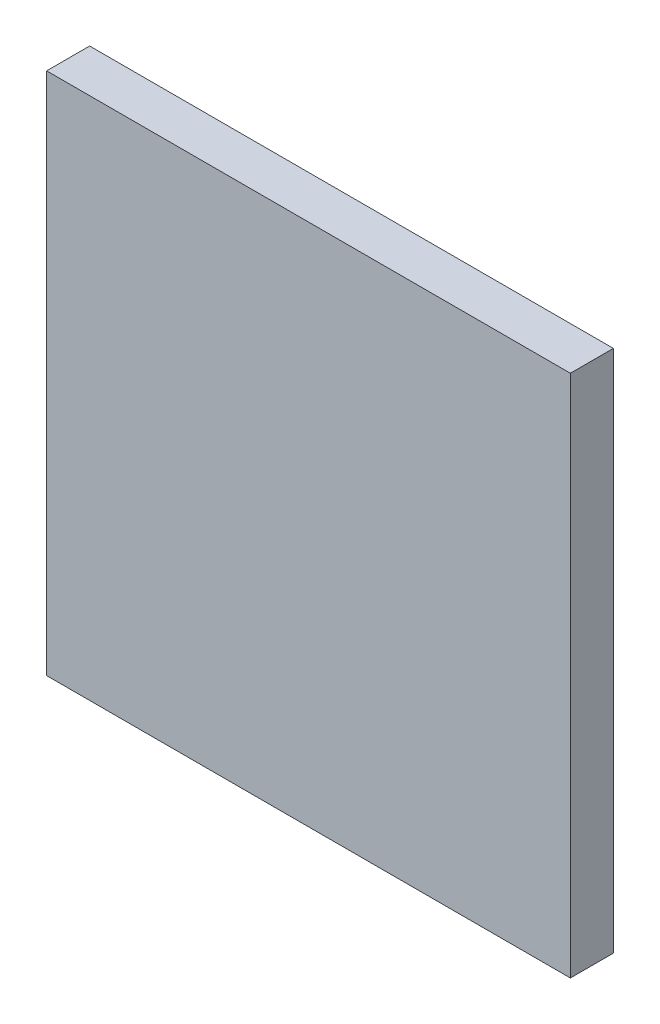
ISO-10303-21;
HEADER;
FILE_DESCRIPTION(('STEP AP214'),'2;1');
FILE_NAME('part.step','',(''),(''),'','','');
FILE_SCHEMA(('AUTOMOTIVE_DESIGN { 1 0 10303 214 1 1 1 1 }'));
ENDSEC;
DATA;
#1=APPLICATION_CONTEXT('core data for automotive mechanical design processes');
#2=APPLICATION_PROTOCOL_DEFINITION('international standard','automotive_design',2000,#1);
#3=PRODUCT_CONTEXT('',#1,'mechanical');
#4=PRODUCT('Part','Part','',(#3));
#5=PRODUCT_RELATED_PRODUCT_CATEGORY('part','',(#4));
#6=PRODUCT_DEFINITION_FORMATION('','',#4);
#7=PRODUCT_DEFINITION_CONTEXT('part definition',#1,'design');
#8=PRODUCT_DEFINITION('design','',#6,#7);
#9=PRODUCT_DEFINITION_SHAPE('','',#8);
#10=(LENGTH_UNIT() NAMED_UNIT(*) SI_UNIT(.MILLI.,.METRE.));
#11=(NAMED_UNIT(*) PLANE_ANGLE_UNIT() SI_UNIT($,.RADIAN.));
#12=(NAMED_UNIT(*) SI_UNIT($,.STERADIAN.) SOLID_ANGLE_UNIT());
#13=UNCERTAINTY_MEASURE_WITH_UNIT(LENGTH_MEASURE(1.E-05),#10,'distance_accuracy_value','');
#14=(GEOMETRIC_REPRESENTATION_CONTEXT(3) GLOBAL_UNCERTAINTY_ASSIGNED_CONTEXT((#13)) GLOBAL_UNIT_ASSIGNED_CONTEXT((#10,
#11,#12)) REPRESENTATION_CONTEXT('',''));
#15=CARTESIAN_POINT('',(0.,0.,0.));
#16=DIRECTION('',(0.,0.,1.));
#17=DIRECTION('',(1.,0.,0.));
#18=AXIS2_PLACEMENT_3D('',#15,#16,#17);
#19=CARTESIAN_POINT('',(-6.9999987,-6.9999987,1.15000024));
#20=DIRECTION('',(0.,0.,1.));
#21=DIRECTION('',(1.,0.,0.));
#22=AXIS2_PLACEMENT_3D('',#19,#20,#21);
#23=PLANE('',#22);
#24=DIRECTION('',(1.,0.,0.));
#25=VECTOR('',#24,1.);
#26=CARTESIAN_POINT('',(-6.9999987,7.00000124,1.15000024));
#27=LINE('',#26,#25);
#28=CARTESIAN_POINT('',(-6.9999987,7.00000124,1.15000024));
#29=VERTEX_POINT('',#28);
#30=CARTESIAN_POINT('',(7.00000124,7.00000124,1.15000024));
#31=VERTEX_POINT('',#30);
#32=EDGE_CURVE('E53',#29,#31,#27,.T.);
#33=ORIENTED_EDGE('',*,*,#32,.F.);
#34=DIRECTION('',(0.,1.,0.));
#35=VECTOR('',#34,1.);
#36=CARTESIAN_POINT('',(-6.9999987,-6.9999987,1.15000024));
#37=LINE('',#36,#35);
#38=CARTESIAN_POINT('',(-6.9999987,-6.9999987,1.15000024));
#39=VERTEX_POINT('',#38);
#40=EDGE_CURVE('E68',#39,#29,#37,.T.);
#41=ORIENTED_EDGE('',*,*,#40,.F.);
#42=DIRECTION('',(1.,0.,0.));
#43=VECTOR('',#42,1.);
#44=CARTESIAN_POINT('',(7.00000124,-6.9999987,1.15000024));
#45=LINE('',#44,#43);
#46=CARTESIAN_POINT('',(7.00000124,-6.9999987,1.15000024));
#47=VERTEX_POINT('',#46);
#48=EDGE_CURVE('E20',#47,#39,#45,.F.);
#49=ORIENTED_EDGE('',*,*,#48,.F.);
#50=DIRECTION('',(0.,1.,0.));
#51=VECTOR('',#50,1.);
#52=CARTESIAN_POINT('',(7.00000124,7.00000124,1.15000024));
#53=LINE('',#52,#51);
#54=EDGE_CURVE('E58',#31,#47,#53,.F.);
#55=ORIENTED_EDGE('',*,*,#54,.F.);
#56=EDGE_LOOP('',(#33,#41,#49,#55));
#57=FACE_BOUND('',#56,.T.);
#58=ADVANCED_FACE('F17',(#57),#23,.T.);
#59=CARTESIAN_POINT('',(7.00000124,-6.9999987,0.));
#60=DIRECTION('',(0.,-1.,0.));
#61=DIRECTION('',(0.,0.,-1.));
#62=AXIS2_PLACEMENT_3D('',#59,#60,#61);
#63=PLANE('',#62);
#64=DIRECTION('',(0.,0.,1.));
#65=VECTOR('',#64,1.);
#66=CARTESIAN_POINT('',(-6.9999987,-6.9999987,0.));
#67=LINE('',#66,#65);
#68=CARTESIAN_POINT('',(-6.9999987,-6.9999987,0.));
#69=VERTEX_POINT('',#68);
#70=EDGE_CURVE('E79',#69,#39,#67,.T.);
#71=ORIENTED_EDGE('',*,*,#70,.F.);
#72=DIRECTION('',(1.,0.,0.));
#73=VECTOR('',#72,1.);
#74=CARTESIAN_POINT('',(-6.9999987,-6.9999987,0.));
#75=LINE('',#74,#73);
#76=CARTESIAN_POINT('',(7.00000124,-6.9999987,0.));
#77=VERTEX_POINT('',#76);
#78=EDGE_CURVE('E74',#69,#77,#75,.T.);
#79=ORIENTED_EDGE('',*,*,#78,.T.);
#80=DIRECTION('',(0.,0.,-1.));
#81=VECTOR('',#80,1.);
#82=CARTESIAN_POINT('',(7.00000124,-6.9999987,0.));
#83=LINE('',#82,#81);
#84=EDGE_CURVE('E63',#47,#77,#83,.T.);
#85=ORIENTED_EDGE('',*,*,#84,.F.);
#86=ORIENTED_EDGE('',*,*,#48,.T.);
#87=EDGE_LOOP('',(#71,#79,#85,#86));
#88=FACE_BOUND('',#87,.T.);
#89=ADVANCED_FACE('F73',(#88),#63,.T.);
#90=CARTESIAN_POINT('',(7.00000124,7.00000124,0.));
#91=DIRECTION('',(1.,0.,0.));
#92=DIRECTION('',(0.,0.,-1.));
#93=AXIS2_PLACEMENT_3D('',#90,#91,#92);
#94=PLANE('',#93);
#95=ORIENTED_EDGE('',*,*,#84,.T.);
#96=DIRECTION('',(0.,1.,0.));
#97=VECTOR('',#96,1.);
#98=CARTESIAN_POINT('',(7.00000124,-6.9999987,0.));
#99=LINE('',#98,#97);
#100=CARTESIAN_POINT('',(7.00000124,7.00000124,0.));
#101=VERTEX_POINT('',#100);
#102=EDGE_CURVE('E84',#77,#101,#99,.T.);
#103=ORIENTED_EDGE('',*,*,#102,.T.);
#104=DIRECTION('',(0.,0.,1.));
#105=VECTOR('',#104,1.);
#106=CARTESIAN_POINT('',(7.00000124,7.00000124,0.));
#107=LINE('',#106,#105);
#108=EDGE_CURVE('E65',#31,#101,#107,.F.);
#109=ORIENTED_EDGE('',*,*,#108,.F.);
#110=ORIENTED_EDGE('',*,*,#54,.T.);
#111=EDGE_LOOP('',(#95,#103,#109,#110));
#112=FACE_BOUND('',#111,.T.);
#113=ADVANCED_FACE('F60',(#112),#94,.T.);
#114=CARTESIAN_POINT('',(-6.9999987,7.00000124,0.));
#115=DIRECTION('',(0.,1.,0.));
#116=DIRECTION('',(0.,0.,1.));
#117=AXIS2_PLACEMENT_3D('',#114,#115,#116);
#118=PLANE('',#117);
#119=ORIENTED_EDGE('',*,*,#108,.T.);
#120=DIRECTION('',(1.,0.,0.));
#121=VECTOR('',#120,1.);
#122=CARTESIAN_POINT('',(-6.9999987,7.00000124,0.));
#123=LINE('',#122,#121);
#124=CARTESIAN_POINT('',(-6.9999987,7.00000124,0.));
#125=VERTEX_POINT('',#124);
#126=EDGE_CURVE('E26',#101,#125,#123,.F.);
#127=ORIENTED_EDGE('',*,*,#126,.T.);
#128=DIRECTION('',(0.,0.,1.));
#129=VECTOR('',#128,1.);
#130=CARTESIAN_POINT('',(-6.9999987,7.00000124,0.));
#131=LINE('',#130,#129);
#132=EDGE_CURVE('E34',#29,#125,#131,.F.);
#133=ORIENTED_EDGE('',*,*,#132,.F.);
#134=ORIENTED_EDGE('',*,*,#32,.T.);
#135=EDGE_LOOP('',(#119,#127,#133,#134));
#136=FACE_BOUND('',#135,.T.);
#137=ADVANCED_FACE('F88',(#136),#118,.T.);
#138=CARTESIAN_POINT('',(-6.9999987,-6.9999987,0.));
#139=DIRECTION('',(-1.,0.,0.));
#140=DIRECTION('',(0.,0.,1.));
#141=AXIS2_PLACEMENT_3D('',#138,#139,#140);
#142=PLANE('',#141);
#143=ORIENTED_EDGE('',*,*,#132,.T.);
#144=DIRECTION('',(0.,1.,0.));
#145=VECTOR('',#144,1.);
#146=CARTESIAN_POINT('',(-6.9999987,-6.9999987,0.));
#147=LINE('',#146,#145);
#148=EDGE_CURVE('E11',#125,#69,#147,.F.);
#149=ORIENTED_EDGE('',*,*,#148,.T.);
#150=ORIENTED_EDGE('',*,*,#70,.T.);
#151=ORIENTED_EDGE('',*,*,#40,.T.);
#152=EDGE_LOOP('',(#143,#149,#150,#151));
#153=FACE_BOUND('',#152,.T.);
#154=ADVANCED_FACE('F91',(#153),#142,.T.);
#155=CARTESIAN_POINT('',(-6.9999987,-6.9999987,0.));
#156=DIRECTION('',(0.,0.,1.));
#157=DIRECTION('',(1.,0.,0.));
#158=AXIS2_PLACEMENT_3D('',#155,#156,#157);
#159=PLANE('',#158);
#160=ORIENTED_EDGE('',*,*,#126,.F.);
#161=ORIENTED_EDGE('',*,*,#102,.F.);
#162=ORIENTED_EDGE('',*,*,#78,.F.);
#163=ORIENTED_EDGE('',*,*,#148,.F.);
#164=EDGE_LOOP('',(#160,#161,#162,#163));
#165=FACE_BOUND('',#164,.T.);
#166=ADVANCED_FACE('F90',(#165),#159,.F.);
#167=CLOSED_SHELL('',(#58,#89,#113,#137,#154,#166));
#168=MANIFOLD_SOLID_BREP('B1',#167);
#169=ADVANCED_BREP_SHAPE_REPRESENTATION('',(#18,#168),#14);
#170=SHAPE_DEFINITION_REPRESENTATION(#9,#169);
ENDSEC;
END-ISO-10303-21;
